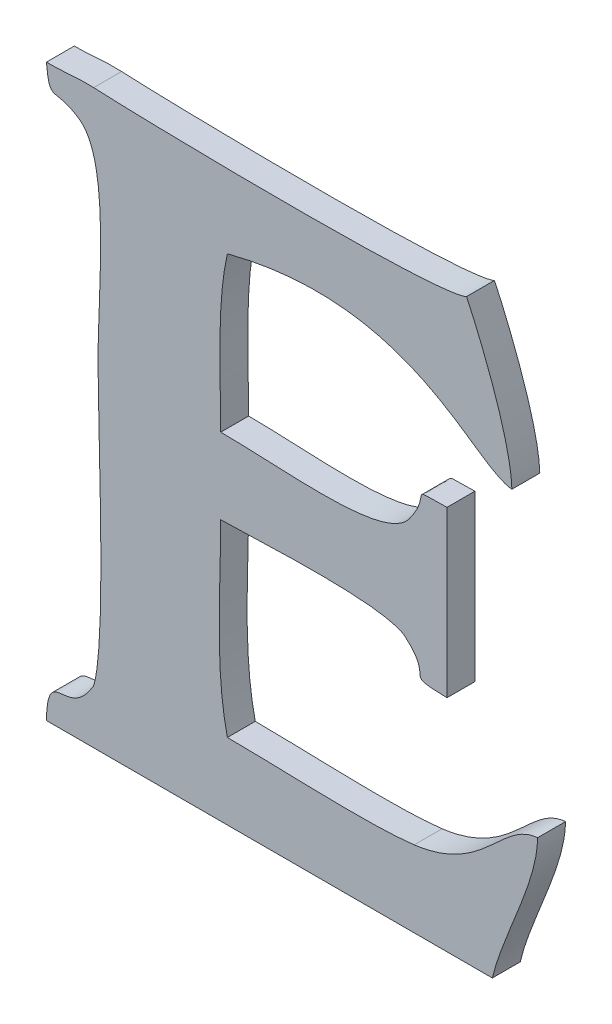
ISO-10303-21;
HEADER;
FILE_DESCRIPTION(('STEP AP214'),'2;1');
FILE_NAME('part.step','',(''),(''),'','','');
FILE_SCHEMA(('AUTOMOTIVE_DESIGN { 1 0 10303 214 1 1 1 1 }'));
ENDSEC;
DATA;
#1=APPLICATION_CONTEXT('core data for automotive mechanical design processes');
#2=APPLICATION_PROTOCOL_DEFINITION('international standard','automotive_design',2000,#1);
#3=PRODUCT_CONTEXT('',#1,'mechanical');
#4=PRODUCT('Part','Part','',(#3));
#5=PRODUCT_RELATED_PRODUCT_CATEGORY('part','',(#4));
#6=PRODUCT_DEFINITION_FORMATION('','',#4);
#7=PRODUCT_DEFINITION_CONTEXT('part definition',#1,'design');
#8=PRODUCT_DEFINITION('design','',#6,#7);
#9=PRODUCT_DEFINITION_SHAPE('','',#8);
#10=(LENGTH_UNIT() NAMED_UNIT(*) SI_UNIT(.MILLI.,.METRE.));
#11=(NAMED_UNIT(*) PLANE_ANGLE_UNIT() SI_UNIT($,.RADIAN.));
#12=(NAMED_UNIT(*) SI_UNIT($,.STERADIAN.) SOLID_ANGLE_UNIT());
#13=UNCERTAINTY_MEASURE_WITH_UNIT(LENGTH_MEASURE(1.E-05),#10,'distance_accuracy_value','');
#14=(GEOMETRIC_REPRESENTATION_CONTEXT(3) GLOBAL_UNCERTAINTY_ASSIGNED_CONTEXT((#13)) GLOBAL_UNIT_ASSIGNED_CONTEXT((#10,
#11,#12)) REPRESENTATION_CONTEXT('',''));
#15=CARTESIAN_POINT('',(0.,0.,0.));
#16=DIRECTION('',(0.,0.,1.));
#17=DIRECTION('',(1.,0.,0.));
#18=AXIS2_PLACEMENT_3D('',#15,#16,#17);
#19=CARTESIAN_POINT('',(50.1462039999998,11.250935,0.001));
#20=CARTESIAN_POINT('',(50.1462039999998,11.250935,0.));
#21=CARTESIAN_POINT('',(50.1452099999998,11.250445,0.001));
#22=CARTESIAN_POINT('',(50.1452099999998,11.250445,0.));
#23=CARTESIAN_POINT('',(50.1352839999998,11.250613,0.001));
#24=CARTESIAN_POINT('',(50.1352839999998,11.250613,0.));
#25=CARTESIAN_POINT('',(50.1328479999998,11.250739,0.001));
#26=CARTESIAN_POINT('',(50.1328479999998,11.250739,0.));
#27=B_SPLINE_SURFACE_WITH_KNOTS('',3,1,((#19,#20),(#21,#22),(#23,#24),(#25,#26)),.UNSPECIFIED.,
.F.,.F.,.F.,(4,4),(2,2),(0.85,0.9),(0.,1.),.UNSPECIFIED.);
#28=CARTESIAN_POINT('',(50.1462039999998,11.250935,0.));
#29=CARTESIAN_POINT('',(50.1452099999998,11.250445,0.));
#30=CARTESIAN_POINT('',(50.1352839999998,11.250613,0.));
#31=CARTESIAN_POINT('',(50.1328479999998,11.250739,0.));
#32=B_SPLINE_CURVE_WITH_KNOTS('',3,(#28,#29,#30,#31),.UNSPECIFIED.,.F.,.F.,(4,4),(0.85,0.9),.UNSPECIFIED.);
#33=CARTESIAN_POINT('',(50.1462039999998,11.250935,0.));
#34=VERTEX_POINT('',#33);
#35=CARTESIAN_POINT('',(50.1328479999998,11.250739,0.));
#36=VERTEX_POINT('',#35);
#37=EDGE_CURVE('E11',#34,#36,#32,.T.);
#38=DIRECTION('',(0.,0.,-1.));
#39=VECTOR('',#38,1.);
#40=CARTESIAN_POINT('',(50.1328479999998,11.250739,0.001));
#41=LINE('',#40,#39);
#42=CARTESIAN_POINT('',(50.1328479999998,11.250739,0.001));
#43=VERTEX_POINT('',#42);
#44=EDGE_CURVE('E28',#43,#36,#41,.T.);
#45=CARTESIAN_POINT('',(50.1462039999998,11.250935,0.001));
#46=CARTESIAN_POINT('',(50.1452099999998,11.250445,0.001));
#47=CARTESIAN_POINT('',(50.1352839999998,11.250613,0.001));
#48=CARTESIAN_POINT('',(50.1328479999998,11.250739,0.001));
#49=B_SPLINE_CURVE_WITH_KNOTS('',3,(#45,#46,#47,#48),.UNSPECIFIED.,.F.,.F.,(4,4),(0.85,0.9),.UNSPECIFIED.);
#50=CARTESIAN_POINT('',(50.1462039999998,11.250935,0.001));
#51=VERTEX_POINT('',#50);
#52=EDGE_CURVE('E449',#51,#43,#49,.T.);
#53=DIRECTION('',(0.,0.,-1.));
#54=VECTOR('',#53,1.);
#55=CARTESIAN_POINT('',(50.1462039999998,11.250935,0.001));
#56=LINE('',#55,#54);
#57=EDGE_CURVE('E40',#51,#34,#56,.T.);
#58=ORIENTED_EDGE('',*,*,#37,.T.);
#59=ORIENTED_EDGE('',*,*,#44,.F.);
#60=ORIENTED_EDGE('',*,*,#52,.F.);
#61=ORIENTED_EDGE('',*,*,#57,.T.);
#62=EDGE_LOOP('',(#58,#59,#60,#61));
#63=FACE_BOUND('',#62,.T.);
#64=ADVANCED_FACE('F17',(#63),#27,.F.);
#65=CARTESIAN_POINT('',(50.1328479999998,11.250739,0.001));
#66=CARTESIAN_POINT('',(50.1328479999998,11.250739,0.));
#67=CARTESIAN_POINT('',(50.1321759999998,11.250767,0.001));
#68=CARTESIAN_POINT('',(50.1321759999998,11.250767,0.));
#69=CARTESIAN_POINT('',(50.1319939999998,11.250683,0.001));
#70=CARTESIAN_POINT('',(50.1319939999998,11.250683,0.));
#71=CARTESIAN_POINT('',(50.1311539999998,11.250683,0.001));
#72=CARTESIAN_POINT('',(50.1311539999998,11.250683,0.));
#73=B_SPLINE_SURFACE_WITH_KNOTS('',3,1,((#65,#66),(#67,#68),(#69,#70),(#71,#72)),.UNSPECIFIED.,
.F.,.F.,.F.,(4,4),(2,2),(0.9,1.),(0.,1.),.UNSPECIFIED.);
#74=CARTESIAN_POINT('',(50.1328479999998,11.250739,0.));
#75=CARTESIAN_POINT('',(50.1321759999998,11.250767,0.));
#76=CARTESIAN_POINT('',(50.1319939999998,11.250683,0.));
#77=CARTESIAN_POINT('',(50.1311539999998,11.250683,0.));
#78=B_SPLINE_CURVE_WITH_KNOTS('',3,(#74,#75,#76,#77),.UNSPECIFIED.,.F.,.F.,(4,4),(0.9,1.),.UNSPECIFIED.);
#79=CARTESIAN_POINT('',(50.1311539999998,11.250683,0.));
#80=VERTEX_POINT('',#79);
#81=EDGE_CURVE('E441',#36,#80,#78,.T.);
#82=DIRECTION('',(0.,0.,-1.));
#83=VECTOR('',#82,1.);
#84=CARTESIAN_POINT('',(50.1311539999998,11.250683,0.001));
#85=LINE('',#84,#83);
#86=CARTESIAN_POINT('',(50.1311539999998,11.250683,0.001));
#87=VERTEX_POINT('',#86);
#88=EDGE_CURVE('E436',#87,#80,#85,.T.);
#89=CARTESIAN_POINT('',(50.1328479999998,11.250739,0.001));
#90=CARTESIAN_POINT('',(50.1321759999998,11.250767,0.001));
#91=CARTESIAN_POINT('',(50.1319939999998,11.250683,0.001));
#92=CARTESIAN_POINT('',(50.1311539999998,11.250683,0.001));
#93=B_SPLINE_CURVE_WITH_KNOTS('',3,(#89,#90,#91,#92),.UNSPECIFIED.,.F.,.F.,(4,4),(0.9,1.),.UNSPECIFIED.);
#94=EDGE_CURVE('E429',#43,#87,#93,.T.);
#95=ORIENTED_EDGE('',*,*,#81,.T.);
#96=ORIENTED_EDGE('',*,*,#88,.F.);
#97=ORIENTED_EDGE('',*,*,#94,.F.);
#98=ORIENTED_EDGE('',*,*,#44,.T.);
#99=EDGE_LOOP('',(#95,#96,#97,#98));
#100=FACE_BOUND('',#99,.T.);
#101=ADVANCED_FACE('F457',(#100),#73,.F.);
#102=CARTESIAN_POINT('',(50.1311539999998,11.250683,0.001));
#103=CARTESIAN_POINT('',(50.1311539999998,11.250683,0.));
#104=CARTESIAN_POINT('',(50.1312799999998,11.249395,0.001));
#105=CARTESIAN_POINT('',(50.1312799999998,11.249395,0.));
#106=CARTESIAN_POINT('',(50.1314059999998,11.250151,0.001));
#107=CARTESIAN_POINT('',(50.1314059999998,11.250151,0.));
#108=CARTESIAN_POINT('',(50.1323439999998,11.249493,0.001));
#109=CARTESIAN_POINT('',(50.1323439999998,11.249493,0.));
#110=B_SPLINE_SURFACE_WITH_KNOTS('',3,1,((#102,#103),(#104,#105),(#106,#107),(#108,#109)),
.UNSPECIFIED.,.F.,.F.,.F.,(4,4),(2,2),(0.,0.05),(0.,1.),.UNSPECIFIED.);
#111=CARTESIAN_POINT('',(50.1311539999998,11.250683,0.));
#112=CARTESIAN_POINT('',(50.1312799999998,11.249395,0.));
#113=CARTESIAN_POINT('',(50.1314059999998,11.250151,0.));
#114=CARTESIAN_POINT('',(50.1323439999998,11.249493,0.));
#115=B_SPLINE_CURVE_WITH_KNOTS('',3,(#111,#112,#113,#114),.UNSPECIFIED.,.F.,.F.,(4,4),(0.,0.05),.UNSPECIFIED.);
#116=CARTESIAN_POINT('',(50.1323439999998,11.249493,0.));
#117=VERTEX_POINT('',#116);
#118=EDGE_CURVE('E424',#80,#117,#115,.T.);
#119=DIRECTION('',(0.,0.,-1.));
#120=VECTOR('',#119,1.);
#121=CARTESIAN_POINT('',(50.1323439999998,11.249493,0.001));
#122=LINE('',#121,#120);
#123=CARTESIAN_POINT('',(50.1323439999998,11.249493,0.001));
#124=VERTEX_POINT('',#123);
#125=EDGE_CURVE('E419',#124,#117,#122,.T.);
#126=CARTESIAN_POINT('',(50.1311539999998,11.250683,0.001));
#127=CARTESIAN_POINT('',(50.1312799999998,11.249395,0.001));
#128=CARTESIAN_POINT('',(50.1314059999998,11.250151,0.001));
#129=CARTESIAN_POINT('',(50.1323439999998,11.249493,0.001));
#130=B_SPLINE_CURVE_WITH_KNOTS('',3,(#126,#127,#128,#129),.UNSPECIFIED.,.F.,.F.,(4,4),(0.,0.05),.UNSPECIFIED.);
#131=EDGE_CURVE('E412',#87,#124,#130,.T.);
#132=ORIENTED_EDGE('',*,*,#118,.T.);
#133=ORIENTED_EDGE('',*,*,#125,.F.);
#134=ORIENTED_EDGE('',*,*,#131,.F.);
#135=ORIENTED_EDGE('',*,*,#88,.T.);
#136=EDGE_LOOP('',(#132,#133,#134,#135));
#137=FACE_BOUND('',#136,.T.);
#138=ADVANCED_FACE('F462',(#137),#110,.F.);
#139=CARTESIAN_POINT('',(50.1323439999998,11.249493,0.001));
#140=CARTESIAN_POINT('',(50.1323439999998,11.249493,0.));
#141=CARTESIAN_POINT('',(50.1334639999998,11.248681,0.001));
#142=CARTESIAN_POINT('',(50.1334639999998,11.248681,0.));
#143=CARTESIAN_POINT('',(50.1330019999998,11.244593,0.001));
#144=CARTESIAN_POINT('',(50.1330019999998,11.244593,0.));
#145=CARTESIAN_POINT('',(50.1330019999998,11.242325,0.001));
#146=CARTESIAN_POINT('',(50.1330019999998,11.242325,0.));
#147=B_SPLINE_SURFACE_WITH_KNOTS('',3,1,((#139,#140),(#141,#142),(#143,#144),(#145,#146)),
.UNSPECIFIED.,.F.,.F.,.F.,(4,4),(2,2),(0.05,0.1),(0.,1.),.UNSPECIFIED.);
#148=CARTESIAN_POINT('',(50.1323439999998,11.249493,0.));
#149=CARTESIAN_POINT('',(50.1334639999998,11.248681,0.));
#150=CARTESIAN_POINT('',(50.1330019999998,11.244593,0.));
#151=CARTESIAN_POINT('',(50.1330019999998,11.242325,0.));
#152=B_SPLINE_CURVE_WITH_KNOTS('',3,(#148,#149,#150,#151),.UNSPECIFIED.,.F.,.F.,(4,4),(0.05,
0.1),.UNSPECIFIED.);
#153=CARTESIAN_POINT('',(50.1330019999998,11.242325,0.));
#154=VERTEX_POINT('',#153);
#155=EDGE_CURVE('E407',#117,#154,#152,.T.);
#156=DIRECTION('',(0.,0.,-1.));
#157=VECTOR('',#156,1.);
#158=CARTESIAN_POINT('',(50.1330019999998,11.242325,0.001));
#159=LINE('',#158,#157);
#160=CARTESIAN_POINT('',(50.1330019999998,11.242325,0.001));
#161=VERTEX_POINT('',#160);
#162=EDGE_CURVE('E402',#161,#154,#159,.T.);
#163=CARTESIAN_POINT('',(50.1323439999998,11.249493,0.001));
#164=CARTESIAN_POINT('',(50.1334639999998,11.248681,0.001));
#165=CARTESIAN_POINT('',(50.1330019999998,11.244593,0.001));
#166=CARTESIAN_POINT('',(50.1330019999998,11.242325,0.001));
#167=B_SPLINE_CURVE_WITH_KNOTS('',3,(#163,#164,#165,#166),.UNSPECIFIED.,.F.,.F.,(4,4),(0.05,
0.1),.UNSPECIFIED.);
#168=EDGE_CURVE('E395',#124,#161,#167,.T.);
#169=ORIENTED_EDGE('',*,*,#155,.T.);
#170=ORIENTED_EDGE('',*,*,#162,.F.);
#171=ORIENTED_EDGE('',*,*,#168,.F.);
#172=ORIENTED_EDGE('',*,*,#125,.T.);
#173=EDGE_LOOP('',(#169,#170,#171,#172));
#174=FACE_BOUND('',#173,.T.);
#175=ADVANCED_FACE('F468',(#174),#147,.F.);
#176=CARTESIAN_POINT('',(50.1330019999998,11.242325,0.001));
#177=CARTESIAN_POINT('',(50.1330019999998,11.242325,0.));
#178=CARTESIAN_POINT('',(50.1330019999998,11.240365,0.001));
#179=CARTESIAN_POINT('',(50.1330019999998,11.240365,0.));
#180=CARTESIAN_POINT('',(50.1333239999998,11.233505,0.001));
#181=CARTESIAN_POINT('',(50.1333239999998,11.233505,0.));
#182=CARTESIAN_POINT('',(50.1328339999998,11.232161,0.001));
#183=CARTESIAN_POINT('',(50.1328339999998,11.232161,0.));
#184=B_SPLINE_SURFACE_WITH_KNOTS('',3,1,((#176,#177),(#178,#179),(#180,#181),(#182,#183)),
.UNSPECIFIED.,.F.,.F.,.F.,(4,4),(2,2),(0.1,0.15),(0.,1.),.UNSPECIFIED.);
#185=CARTESIAN_POINT('',(50.1330019999998,11.242325,0.));
#186=CARTESIAN_POINT('',(50.1330019999998,11.240365,0.));
#187=CARTESIAN_POINT('',(50.1333239999998,11.233505,0.));
#188=CARTESIAN_POINT('',(50.1328339999998,11.232161,0.));
#189=B_SPLINE_CURVE_WITH_KNOTS('',3,(#185,#186,#187,#188),.UNSPECIFIED.,.F.,.F.,(4,4),(0.1,
0.15),.UNSPECIFIED.);
#190=CARTESIAN_POINT('',(50.1328339999998,11.232161,0.));
#191=VERTEX_POINT('',#190);
#192=EDGE_CURVE('E390',#154,#191,#189,.T.);
#193=DIRECTION('',(0.,0.,-1.));
#194=VECTOR('',#193,1.);
#195=CARTESIAN_POINT('',(50.1328339999998,11.232161,0.001));
#196=LINE('',#195,#194);
#197=CARTESIAN_POINT('',(50.1328339999998,11.232161,0.001));
#198=VERTEX_POINT('',#197);
#199=EDGE_CURVE('E385',#198,#191,#196,.T.);
#200=CARTESIAN_POINT('',(50.1330019999998,11.242325,0.001));
#201=CARTESIAN_POINT('',(50.1330019999998,11.240365,0.001));
#202=CARTESIAN_POINT('',(50.1333239999998,11.233505,0.001));
#203=CARTESIAN_POINT('',(50.1328339999998,11.232161,0.001));
#204=B_SPLINE_CURVE_WITH_KNOTS('',3,(#200,#201,#202,#203),.UNSPECIFIED.,.F.,.F.,(4,4),(0.1,
0.15),.UNSPECIFIED.);
#205=EDGE_CURVE('E378',#161,#198,#204,.T.);
#206=ORIENTED_EDGE('',*,*,#192,.T.);
#207=ORIENTED_EDGE('',*,*,#199,.F.);
#208=ORIENTED_EDGE('',*,*,#205,.F.);
#209=ORIENTED_EDGE('',*,*,#162,.T.);
#210=EDGE_LOOP('',(#206,#207,#208,#209));
#211=FACE_BOUND('',#210,.T.);
#212=ADVANCED_FACE('F472',(#211),#184,.F.);
#213=CARTESIAN_POINT('',(50.1328339999998,11.232161,0.001));
#214=CARTESIAN_POINT('',(50.1328339999998,11.232161,0.));
#215=CARTESIAN_POINT('',(50.1319239999998,11.230593,0.001));
#216=CARTESIAN_POINT('',(50.1319239999998,11.230593,0.));
#217=CARTESIAN_POINT('',(50.1311959999998,11.232203,0.001));
#218=CARTESIAN_POINT('',(50.1311959999998,11.232203,0.));
#219=CARTESIAN_POINT('',(50.1311539999998,11.230257,0.001));
#220=CARTESIAN_POINT('',(50.1311539999998,11.230257,0.));
#221=B_SPLINE_SURFACE_WITH_KNOTS('',3,1,((#213,#214),(#215,#216),(#217,#218),(#219,#220)),
.UNSPECIFIED.,.F.,.F.,.F.,(4,4),(2,2),(0.15,0.2),(0.,1.),.UNSPECIFIED.);
#222=CARTESIAN_POINT('',(50.1328339999998,11.232161,0.));
#223=CARTESIAN_POINT('',(50.1319239999998,11.230593,0.));
#224=CARTESIAN_POINT('',(50.1311959999998,11.232203,0.));
#225=CARTESIAN_POINT('',(50.1311539999998,11.230257,0.));
#226=B_SPLINE_CURVE_WITH_KNOTS('',3,(#222,#223,#224,#225),.UNSPECIFIED.,.F.,.F.,(4,4),(0.15,
0.2),.UNSPECIFIED.);
#227=CARTESIAN_POINT('',(50.1311539999998,11.230257,0.));
#228=VERTEX_POINT('',#227);
#229=EDGE_CURVE('E373',#191,#228,#226,.T.);
#230=DIRECTION('',(0.,0.,-1.));
#231=VECTOR('',#230,1.);
#232=CARTESIAN_POINT('',(50.1311539999998,11.230257,0.001));
#233=LINE('',#232,#231);
#234=CARTESIAN_POINT('',(50.1311539999998,11.230257,0.001));
#235=VERTEX_POINT('',#234);
#236=EDGE_CURVE('E368',#235,#228,#233,.T.);
#237=CARTESIAN_POINT('',(50.1328339999998,11.232161,0.001));
#238=CARTESIAN_POINT('',(50.1319239999998,11.230593,0.001));
#239=CARTESIAN_POINT('',(50.1311959999998,11.232203,0.001));
#240=CARTESIAN_POINT('',(50.1311539999998,11.230257,0.001));
#241=B_SPLINE_CURVE_WITH_KNOTS('',3,(#237,#238,#239,#240),.UNSPECIFIED.,.F.,.F.,(4,4),(0.15,
0.2),.UNSPECIFIED.);
#242=EDGE_CURVE('E364',#198,#235,#241,.T.);
#243=ORIENTED_EDGE('',*,*,#229,.T.);
#244=ORIENTED_EDGE('',*,*,#236,.F.);
#245=ORIENTED_EDGE('',*,*,#242,.F.);
#246=ORIENTED_EDGE('',*,*,#199,.T.);
#247=EDGE_LOOP('',(#243,#244,#245,#246));
#248=FACE_BOUND('',#247,.T.);
#249=ADVANCED_FACE('F477',(#248),#221,.F.);
#250=CARTESIAN_POINT('',(0.,11.230257,0.001));
#251=DIRECTION('',(0.,1.,0.));
#252=DIRECTION('',(0.,0.,1.));
#253=AXIS2_PLACEMENT_3D('',#250,#251,#252);
#254=PLANE('',#253);
#255=DIRECTION('',(1.,0.,0.));
#256=VECTOR('',#255,1.);
#257=CARTESIAN_POINT('',(0.,11.230257,0.));
#258=LINE('',#257,#256);
#259=CARTESIAN_POINT('',(50.1471279999998,11.230257,0.));
#260=VERTEX_POINT('',#259);
#261=EDGE_CURVE('E362',#228,#260,#258,.T.);
#262=ORIENTED_EDGE('',*,*,#261,.T.);
#263=DIRECTION('',(0.,0.,-1.));
#264=VECTOR('',#263,1.);
#265=CARTESIAN_POINT('',(50.1471279999998,11.230257,0.001));
#266=LINE('',#265,#264);
#267=CARTESIAN_POINT('',(50.1471279999998,11.230257,0.001));
#268=VERTEX_POINT('',#267);
#269=EDGE_CURVE('E359',#268,#260,#266,.T.);
#270=ORIENTED_EDGE('',*,*,#269,.F.);
#271=DIRECTION('',(1.,0.,0.));
#272=VECTOR('',#271,1.);
#273=CARTESIAN_POINT('',(0.,11.230257,0.001));
#274=LINE('',#273,#272);
#275=EDGE_CURVE('E353',#235,#268,#274,.T.);
#276=ORIENTED_EDGE('',*,*,#275,.F.);
#277=ORIENTED_EDGE('',*,*,#236,.T.);
#278=EDGE_LOOP('',(#262,#270,#276,#277));
#279=FACE_BOUND('',#278,.T.);
#280=ADVANCED_FACE('F530',(#279),#254,.F.);
#281=CARTESIAN_POINT('',(50.1471279999998,11.230257,0.001));
#282=CARTESIAN_POINT('',(50.1471279999998,11.230257,0.));
#283=CARTESIAN_POINT('',(50.1474919999998,11.231825,0.001));
#284=CARTESIAN_POINT('',(50.1474919999998,11.231825,0.));
#285=CARTESIAN_POINT('',(50.1487239999998,11.233897,0.001));
#286=CARTESIAN_POINT('',(50.1487239999998,11.233897,0.));
#287=CARTESIAN_POINT('',(50.1487519999998,11.235423,0.001));
#288=CARTESIAN_POINT('',(50.1487519999998,11.235423,0.));
#289=B_SPLINE_SURFACE_WITH_KNOTS('',3,1,((#281,#282),(#283,#284),(#285,#286),(#287,#288)),
.UNSPECIFIED.,.F.,.F.,.F.,(4,4),(2,2),(0.25,0.3),(0.,1.),.UNSPECIFIED.);
#290=CARTESIAN_POINT('',(50.1471279999998,11.230257,0.));
#291=CARTESIAN_POINT('',(50.1474919999998,11.231825,0.));
#292=CARTESIAN_POINT('',(50.1487239999998,11.233897,0.));
#293=CARTESIAN_POINT('',(50.1487519999998,11.235423,0.));
#294=B_SPLINE_CURVE_WITH_KNOTS('',3,(#290,#291,#292,#293),.UNSPECIFIED.,.F.,.F.,(4,4),(0.25,
0.3),.UNSPECIFIED.);
#295=CARTESIAN_POINT('',(50.1487519999998,11.235423,0.));
#296=VERTEX_POINT('',#295);
#297=EDGE_CURVE('E348',#260,#296,#294,.T.);
#298=DIRECTION('',(0.,0.,-1.));
#299=VECTOR('',#298,1.);
#300=CARTESIAN_POINT('',(50.1487519999998,11.235423,0.001));
#301=LINE('',#300,#299);
#302=CARTESIAN_POINT('',(50.1487519999998,11.235423,0.001));
#303=VERTEX_POINT('',#302);
#304=EDGE_CURVE('E343',#303,#296,#301,.T.);
#305=CARTESIAN_POINT('',(50.1471279999998,11.230257,0.001));
#306=CARTESIAN_POINT('',(50.1474919999998,11.231825,0.001));
#307=CARTESIAN_POINT('',(50.1487239999998,11.233897,0.001));
#308=CARTESIAN_POINT('',(50.1487519999998,11.235423,0.001));
#309=B_SPLINE_CURVE_WITH_KNOTS('',3,(#305,#306,#307,#308),.UNSPECIFIED.,.F.,.F.,(4,4),(0.25,
0.3),.UNSPECIFIED.);
#310=EDGE_CURVE('E336',#268,#303,#309,.T.);
#311=ORIENTED_EDGE('',*,*,#297,.T.);
#312=ORIENTED_EDGE('',*,*,#304,.F.);
#313=ORIENTED_EDGE('',*,*,#310,.F.);
#314=ORIENTED_EDGE('',*,*,#269,.T.);
#315=EDGE_LOOP('',(#311,#312,#313,#314));
#316=FACE_BOUND('',#315,.T.);
#317=ADVANCED_FACE('F483',(#316),#289,.F.);
#318=CARTESIAN_POINT('',(50.1487519999998,11.235423,0.001));
#319=CARTESIAN_POINT('',(50.1487519999998,11.235423,0.));
#320=CARTESIAN_POINT('',(50.1474219999998,11.235297,0.001));
#321=CARTESIAN_POINT('',(50.1474219999998,11.235297,0.));
#322=CARTESIAN_POINT('',(50.1468759999998,11.233309,0.001));
#323=CARTESIAN_POINT('',(50.1468759999998,11.233309,0.));
#324=CARTESIAN_POINT('',(50.1443279999998,11.232987,0.001));
#325=CARTESIAN_POINT('',(50.1443279999998,11.232987,0.));
#326=B_SPLINE_SURFACE_WITH_KNOTS('',3,1,((#318,#319),(#320,#321),(#322,#323),(#324,#325)),
.UNSPECIFIED.,.F.,.F.,.F.,(4,4),(2,2),(0.3,0.35),(0.,1.),.UNSPECIFIED.);
#327=CARTESIAN_POINT('',(50.1487519999998,11.235423,0.));
#328=CARTESIAN_POINT('',(50.1474219999998,11.235297,0.));
#329=CARTESIAN_POINT('',(50.1468759999998,11.233309,0.));
#330=CARTESIAN_POINT('',(50.1443279999998,11.232987,0.));
#331=B_SPLINE_CURVE_WITH_KNOTS('',3,(#327,#328,#329,#330),.UNSPECIFIED.,.F.,.F.,(4,4),(0.3,
0.35),.UNSPECIFIED.);
#332=CARTESIAN_POINT('',(50.1443279999998,11.232987,0.));
#333=VERTEX_POINT('',#332);
#334=EDGE_CURVE('E331',#296,#333,#331,.T.);
#335=DIRECTION('',(0.,0.,-1.));
#336=VECTOR('',#335,1.);
#337=CARTESIAN_POINT('',(50.1443279999998,11.232987,0.001));
#338=LINE('',#337,#336);
#339=CARTESIAN_POINT('',(50.1443279999998,11.232987,0.001));
#340=VERTEX_POINT('',#339);
#341=EDGE_CURVE('E326',#340,#333,#338,.T.);
#342=CARTESIAN_POINT('',(50.1487519999998,11.235423,0.001));
#343=CARTESIAN_POINT('',(50.1474219999998,11.235297,0.001));
#344=CARTESIAN_POINT('',(50.1468759999998,11.233309,0.001));
#345=CARTESIAN_POINT('',(50.1443279999998,11.232987,0.001));
#346=B_SPLINE_CURVE_WITH_KNOTS('',3,(#342,#343,#344,#345),.UNSPECIFIED.,.F.,.F.,(4,4),(0.3,
0.35),.UNSPECIFIED.);
#347=EDGE_CURVE('E319',#303,#340,#346,.T.);
#348=ORIENTED_EDGE('',*,*,#334,.T.);
#349=ORIENTED_EDGE('',*,*,#341,.F.);
#350=ORIENTED_EDGE('',*,*,#347,.F.);
#351=ORIENTED_EDGE('',*,*,#304,.T.);
#352=EDGE_LOOP('',(#348,#349,#350,#351));
#353=FACE_BOUND('',#352,.T.);
#354=ADVANCED_FACE('F489',(#353),#326,.F.);
#355=CARTESIAN_POINT('',(50.1443279999998,11.232987,0.001));
#356=CARTESIAN_POINT('',(50.1443279999998,11.232987,0.));
#357=CARTESIAN_POINT('',(50.1425779999998,11.232777,0.001));
#358=CARTESIAN_POINT('',(50.1425779999998,11.232777,0.));
#359=CARTESIAN_POINT('',(50.1395259999998,11.232973,0.001));
#360=CARTESIAN_POINT('',(50.1395259999998,11.232973,0.));
#361=CARTESIAN_POINT('',(50.1376359999998,11.232973,0.001));
#362=CARTESIAN_POINT('',(50.1376359999998,11.232973,0.));
#363=B_SPLINE_SURFACE_WITH_KNOTS('',3,1,((#355,#356),(#357,#358),(#359,#360),(#361,#362)),
.UNSPECIFIED.,.F.,.F.,.F.,(4,4),(2,2),(0.35,0.4),(0.,1.),.UNSPECIFIED.);
#364=CARTESIAN_POINT('',(50.1443279999998,11.232987,0.));
#365=CARTESIAN_POINT('',(50.1425779999998,11.232777,0.));
#366=CARTESIAN_POINT('',(50.1395259999998,11.232973,0.));
#367=CARTESIAN_POINT('',(50.1376359999998,11.232973,0.));
#368=B_SPLINE_CURVE_WITH_KNOTS('',3,(#364,#365,#366,#367),.UNSPECIFIED.,.F.,.F.,(4,4),(0.35,
0.4),.UNSPECIFIED.);
#369=CARTESIAN_POINT('',(50.1376359999998,11.232973,0.));
#370=VERTEX_POINT('',#369);
#371=EDGE_CURVE('E314',#333,#370,#368,.T.);
#372=DIRECTION('',(0.,0.,-1.));
#373=VECTOR('',#372,1.);
#374=CARTESIAN_POINT('',(50.1376359999998,11.232973,0.001));
#375=LINE('',#374,#373);
#376=CARTESIAN_POINT('',(50.1376359999998,11.232973,0.001));
#377=VERTEX_POINT('',#376);
#378=EDGE_CURVE('E309',#377,#370,#375,.T.);
#379=CARTESIAN_POINT('',(50.1443279999998,11.232987,0.001));
#380=CARTESIAN_POINT('',(50.1425779999998,11.232777,0.001));
#381=CARTESIAN_POINT('',(50.1395259999998,11.232973,0.001));
#382=CARTESIAN_POINT('',(50.1376359999998,11.232973,0.001));
#383=B_SPLINE_CURVE_WITH_KNOTS('',3,(#379,#380,#381,#382),.UNSPECIFIED.,.F.,.F.,(4,4),(0.35,
0.4),.UNSPECIFIED.);
#384=EDGE_CURVE('E302',#340,#377,#383,.T.);
#385=ORIENTED_EDGE('',*,*,#371,.T.);
#386=ORIENTED_EDGE('',*,*,#378,.F.);
#387=ORIENTED_EDGE('',*,*,#384,.F.);
#388=ORIENTED_EDGE('',*,*,#341,.T.);
#389=EDGE_LOOP('',(#385,#386,#387,#388));
#390=FACE_BOUND('',#389,.T.);
#391=ADVANCED_FACE('F495',(#390),#363,.F.);
#392=CARTESIAN_POINT('',(50.1376359999998,11.232973,0.001));
#393=CARTESIAN_POINT('',(50.1376359999998,11.232973,0.));
#394=CARTESIAN_POINT('',(50.1371739999998,11.234989,0.001));
#395=CARTESIAN_POINT('',(50.1371739999998,11.234989,0.));
#396=CARTESIAN_POINT('',(50.1373979999998,11.237439,0.001));
#397=CARTESIAN_POINT('',(50.1373979999998,11.237439,0.));
#398=CARTESIAN_POINT('',(50.1373979999998,11.239609,0.001));
#399=CARTESIAN_POINT('',(50.1373979999998,11.239609,0.));
#400=B_SPLINE_SURFACE_WITH_KNOTS('',3,1,((#392,#393),(#394,#395),(#396,#397),(#398,#399)),
.UNSPECIFIED.,.F.,.F.,.F.,(4,4),(2,2),(0.4,0.45),(0.,1.),.UNSPECIFIED.);
#401=CARTESIAN_POINT('',(50.1376359999998,11.232973,0.));
#402=CARTESIAN_POINT('',(50.1371739999998,11.234989,0.));
#403=CARTESIAN_POINT('',(50.1373979999998,11.237439,0.));
#404=CARTESIAN_POINT('',(50.1373979999998,11.239609,0.));
#405=B_SPLINE_CURVE_WITH_KNOTS('',3,(#401,#402,#403,#404),.UNSPECIFIED.,.F.,.F.,(4,4),(0.4,
0.45),.UNSPECIFIED.);
#406=CARTESIAN_POINT('',(50.1373979999998,11.239609,0.));
#407=VERTEX_POINT('',#406);
#408=EDGE_CURVE('E297',#370,#407,#405,.T.);
#409=DIRECTION('',(0.,0.,-1.));
#410=VECTOR('',#409,1.);
#411=CARTESIAN_POINT('',(50.1373979999998,11.239609,0.001));
#412=LINE('',#411,#410);
#413=CARTESIAN_POINT('',(50.1373979999998,11.239609,0.001));
#414=VERTEX_POINT('',#413);
#415=EDGE_CURVE('E292',#414,#407,#412,.T.);
#416=CARTESIAN_POINT('',(50.1376359999998,11.232973,0.001));
#417=CARTESIAN_POINT('',(50.1371739999998,11.234989,0.001));
#418=CARTESIAN_POINT('',(50.1373979999998,11.237439,0.001));
#419=CARTESIAN_POINT('',(50.1373979999998,11.239609,0.001));
#420=B_SPLINE_CURVE_WITH_KNOTS('',3,(#416,#417,#418,#419),.UNSPECIFIED.,.F.,.F.,(4,4),(0.4,
0.45),.UNSPECIFIED.);
#421=EDGE_CURVE('E285',#377,#414,#420,.T.);
#422=ORIENTED_EDGE('',*,*,#408,.T.);
#423=ORIENTED_EDGE('',*,*,#415,.F.);
#424=ORIENTED_EDGE('',*,*,#421,.F.);
#425=ORIENTED_EDGE('',*,*,#378,.T.);
#426=EDGE_LOOP('',(#422,#423,#424,#425));
#427=FACE_BOUND('',#426,.T.);
#428=ADVANCED_FACE('F499',(#427),#400,.F.);
#429=CARTESIAN_POINT('',(50.1373979999998,11.239609,0.001));
#430=CARTESIAN_POINT('',(50.1373979999998,11.239609,0.));
#431=CARTESIAN_POINT('',(50.1385039999998,11.239609,0.001));
#432=CARTESIAN_POINT('',(50.1385039999998,11.239609,0.));
#433=CARTESIAN_POINT('',(50.1432639999998,11.239931,0.001));
#434=CARTESIAN_POINT('',(50.1432639999998,11.239931,0.));
#435=CARTESIAN_POINT('',(50.1440199999998,11.239273,0.001));
#436=CARTESIAN_POINT('',(50.1440199999998,11.239273,0.));
#437=B_SPLINE_SURFACE_WITH_KNOTS('',3,1,((#429,#430),(#431,#432),(#433,#434),(#435,#436)),
.UNSPECIFIED.,.F.,.F.,.F.,(4,4),(2,2),(0.45,0.5),(0.,1.),.UNSPECIFIED.);
#438=CARTESIAN_POINT('',(50.1373979999998,11.239609,0.));
#439=CARTESIAN_POINT('',(50.1385039999998,11.239609,0.));
#440=CARTESIAN_POINT('',(50.1432639999998,11.239931,0.));
#441=CARTESIAN_POINT('',(50.1440199999998,11.239273,0.));
#442=B_SPLINE_CURVE_WITH_KNOTS('',3,(#438,#439,#440,#441),.UNSPECIFIED.,.F.,.F.,(4,4),(0.45,
0.5),.UNSPECIFIED.);
#443=CARTESIAN_POINT('',(50.1440199999998,11.239273,0.));
#444=VERTEX_POINT('',#443);
#445=EDGE_CURVE('E280',#407,#444,#442,.T.);
#446=DIRECTION('',(0.,0.,-1.));
#447=VECTOR('',#446,1.);
#448=CARTESIAN_POINT('',(50.1440199999998,11.239273,0.001));
#449=LINE('',#448,#447);
#450=CARTESIAN_POINT('',(50.1440199999998,11.239273,0.001));
#451=VERTEX_POINT('',#450);
#452=EDGE_CURVE('E275',#451,#444,#449,.T.);
#453=CARTESIAN_POINT('',(50.1373979999998,11.239609,0.001));
#454=CARTESIAN_POINT('',(50.1385039999998,11.239609,0.001));
#455=CARTESIAN_POINT('',(50.1432639999998,11.239931,0.001));
#456=CARTESIAN_POINT('',(50.1440199999998,11.239273,0.001));
#457=B_SPLINE_CURVE_WITH_KNOTS('',3,(#453,#454,#455,#456),.UNSPECIFIED.,.F.,.F.,(4,4),(0.45,
0.5),.UNSPECIFIED.);
#458=EDGE_CURVE('E268',#414,#451,#457,.T.);
#459=ORIENTED_EDGE('',*,*,#445,.T.);
#460=ORIENTED_EDGE('',*,*,#452,.F.);
#461=ORIENTED_EDGE('',*,*,#458,.F.);
#462=ORIENTED_EDGE('',*,*,#415,.T.);
#463=EDGE_LOOP('',(#459,#460,#461,#462));
#464=FACE_BOUND('',#463,.T.);
#465=ADVANCED_FACE('F504',(#464),#437,.F.);
#466=CARTESIAN_POINT('',(50.1440199999998,11.239273,0.001));
#467=CARTESIAN_POINT('',(50.1440199999998,11.239273,0.));
#468=CARTESIAN_POINT('',(50.1451259999998,11.238307,0.001));
#469=CARTESIAN_POINT('',(50.1451259999998,11.238307,0.));
#470=CARTESIAN_POINT('',(50.1437959999998,11.238181,0.001));
#471=CARTESIAN_POINT('',(50.1437959999998,11.238181,0.));
#472=CARTESIAN_POINT('',(50.1455039999998,11.238139,0.001));
#473=CARTESIAN_POINT('',(50.1455039999998,11.238139,0.));
#474=B_SPLINE_SURFACE_WITH_KNOTS('',3,1,((#466,#467),(#468,#469),(#470,#471),(#472,#473)),
.UNSPECIFIED.,.F.,.F.,.F.,(4,4),(2,2),(0.5,0.55),(0.,1.),.UNSPECIFIED.);
#475=CARTESIAN_POINT('',(50.1440199999998,11.239273,0.));
#476=CARTESIAN_POINT('',(50.1451259999998,11.238307,0.));
#477=CARTESIAN_POINT('',(50.1437959999998,11.238181,0.));
#478=CARTESIAN_POINT('',(50.1455039999998,11.238139,0.));
#479=B_SPLINE_CURVE_WITH_KNOTS('',3,(#475,#476,#477,#478),.UNSPECIFIED.,.F.,.F.,(4,4),(0.5,
0.55),.UNSPECIFIED.);
#480=CARTESIAN_POINT('',(50.1455039999998,11.238139,0.));
#481=VERTEX_POINT('',#480);
#482=EDGE_CURVE('E263',#444,#481,#479,.T.);
#483=DIRECTION('',(0.,0.,-1.));
#484=VECTOR('',#483,1.);
#485=CARTESIAN_POINT('',(50.1455039999998,11.238139,0.001));
#486=LINE('',#485,#484);
#487=CARTESIAN_POINT('',(50.1455039999998,11.238139,0.001));
#488=VERTEX_POINT('',#487);
#489=EDGE_CURVE('E258',#488,#481,#486,.T.);
#490=CARTESIAN_POINT('',(50.1440199999998,11.239273,0.001));
#491=CARTESIAN_POINT('',(50.1451259999998,11.238307,0.001));
#492=CARTESIAN_POINT('',(50.1437959999998,11.238181,0.001));
#493=CARTESIAN_POINT('',(50.1455039999998,11.238139,0.001));
#494=B_SPLINE_CURVE_WITH_KNOTS('',3,(#490,#491,#492,#493),.UNSPECIFIED.,.F.,.F.,(4,4),(0.5,
0.55),.UNSPECIFIED.);
#495=EDGE_CURVE('E254',#451,#488,#494,.T.);
#496=ORIENTED_EDGE('',*,*,#482,.T.);
#497=ORIENTED_EDGE('',*,*,#489,.F.);
#498=ORIENTED_EDGE('',*,*,#495,.F.);
#499=ORIENTED_EDGE('',*,*,#452,.T.);
#500=EDGE_LOOP('',(#496,#497,#498,#499));
#501=FACE_BOUND('',#500,.T.);
#502=ADVANCED_FACE('F510',(#501),#474,.F.);
#503=CARTESIAN_POINT('',(50.1455039999998,0.,0.001));
#504=DIRECTION('',(-1.,0.,0.));
#505=DIRECTION('',(0.,0.,1.));
#506=AXIS2_PLACEMENT_3D('',#503,#504,#505);
#507=PLANE('',#506);
#508=DIRECTION('',(0.,1.,0.));
#509=VECTOR('',#508,1.);
#510=CARTESIAN_POINT('',(50.1455039999998,0.,0.));
#511=LINE('',#510,#509);
#512=CARTESIAN_POINT('',(50.1455039999998,11.244047,0.));
#513=VERTEX_POINT('',#512);
#514=EDGE_CURVE('E252',#481,#513,#511,.T.);
#515=ORIENTED_EDGE('',*,*,#514,.T.);
#516=DIRECTION('',(0.,0.,-1.));
#517=VECTOR('',#516,1.);
#518=CARTESIAN_POINT('',(50.1455039999998,11.244047,0.001));
#519=LINE('',#518,#517);
#520=CARTESIAN_POINT('',(50.1455039999998,11.244047,0.001));
#521=VERTEX_POINT('',#520);
#522=EDGE_CURVE('E249',#521,#513,#519,.T.);
#523=ORIENTED_EDGE('',*,*,#522,.F.);
#524=DIRECTION('',(0.,1.,0.));
#525=VECTOR('',#524,1.);
#526=CARTESIAN_POINT('',(50.1455039999998,0.,0.001));
#527=LINE('',#526,#525);
#528=EDGE_CURVE('E243',#488,#521,#527,.T.);
#529=ORIENTED_EDGE('',*,*,#528,.F.);
#530=ORIENTED_EDGE('',*,*,#489,.T.);
#531=EDGE_LOOP('',(#515,#523,#529,#530));
#532=FACE_BOUND('',#531,.T.);
#533=ADVANCED_FACE('F514',(#532),#507,.F.);
#534=CARTESIAN_POINT('',(50.1455039999998,11.244047,0.001));
#535=CARTESIAN_POINT('',(50.1455039999998,11.244047,0.));
#536=CARTESIAN_POINT('',(50.1439919999998,11.244005,0.001));
#537=CARTESIAN_POINT('',(50.1439919999998,11.244005,0.));
#538=CARTESIAN_POINT('',(50.1450139999998,11.244201,0.001));
#539=CARTESIAN_POINT('',(50.1450139999998,11.244201,0.));
#540=CARTESIAN_POINT('',(50.1441599999998,11.243025,0.001));
#541=CARTESIAN_POINT('',(50.1441599999998,11.243025,0.));
#542=B_SPLINE_SURFACE_WITH_KNOTS('',3,1,((#534,#535),(#536,#537),(#538,#539),(#540,#541)),
.UNSPECIFIED.,.F.,.F.,.F.,(4,4),(2,2),(0.6,0.65),(0.,1.),.UNSPECIFIED.);
#543=CARTESIAN_POINT('',(50.1455039999998,11.244047,0.));
#544=CARTESIAN_POINT('',(50.1439919999998,11.244005,0.));
#545=CARTESIAN_POINT('',(50.1450139999998,11.244201,0.));
#546=CARTESIAN_POINT('',(50.1441599999998,11.243025,0.));
#547=B_SPLINE_CURVE_WITH_KNOTS('',3,(#543,#544,#545,#546),.UNSPECIFIED.,.F.,.F.,(4,4),(0.6,
0.65),.UNSPECIFIED.);
#548=CARTESIAN_POINT('',(50.1441599999998,11.243025,0.));
#549=VERTEX_POINT('',#548);
#550=EDGE_CURVE('E238',#513,#549,#547,.T.);
#551=DIRECTION('',(0.,0.,-1.));
#552=VECTOR('',#551,1.);
#553=CARTESIAN_POINT('',(50.1441599999998,11.243025,0.001));
#554=LINE('',#553,#552);
#555=CARTESIAN_POINT('',(50.1441599999998,11.243025,0.001));
#556=VERTEX_POINT('',#555);
#557=EDGE_CURVE('E233',#556,#549,#554,.T.);
#558=CARTESIAN_POINT('',(50.1455039999998,11.244047,0.001));
#559=CARTESIAN_POINT('',(50.1439919999998,11.244005,0.001));
#560=CARTESIAN_POINT('',(50.1450139999998,11.244201,0.001));
#561=CARTESIAN_POINT('',(50.1441599999998,11.243025,0.001));
#562=B_SPLINE_CURVE_WITH_KNOTS('',3,(#558,#559,#560,#561),.UNSPECIFIED.,.F.,.F.,(4,4),(0.6,
0.65),.UNSPECIFIED.);
#563=EDGE_CURVE('E226',#521,#556,#562,.T.);
#564=ORIENTED_EDGE('',*,*,#550,.T.);
#565=ORIENTED_EDGE('',*,*,#557,.F.);
#566=ORIENTED_EDGE('',*,*,#563,.F.);
#567=ORIENTED_EDGE('',*,*,#522,.T.);
#568=EDGE_LOOP('',(#564,#565,#566,#567));
#569=FACE_BOUND('',#568,.T.);
#570=ADVANCED_FACE('F517',(#569),#542,.F.);
#571=CARTESIAN_POINT('',(50.1441599999998,11.243025,0.001));
#572=CARTESIAN_POINT('',(50.1441599999998,11.243025,0.));
#573=CARTESIAN_POINT('',(50.1432779999998,11.241821,0.001));
#574=CARTESIAN_POINT('',(50.1432779999998,11.241821,0.));
#575=CARTESIAN_POINT('',(50.1397499999998,11.242325,0.001));
#576=CARTESIAN_POINT('',(50.1397499999998,11.242325,0.));
#577=CARTESIAN_POINT('',(50.1373979999998,11.242325,0.001));
#578=CARTESIAN_POINT('',(50.1373979999998,11.242325,0.));
#579=B_SPLINE_SURFACE_WITH_KNOTS('',3,1,((#571,#572),(#573,#574),(#575,#576),(#577,#578)),
.UNSPECIFIED.,.F.,.F.,.F.,(4,4),(2,2),(0.65,0.7),(0.,1.),.UNSPECIFIED.);
#580=CARTESIAN_POINT('',(50.1441599999998,11.243025,0.));
#581=CARTESIAN_POINT('',(50.1432779999998,11.241821,0.));
#582=CARTESIAN_POINT('',(50.1397499999998,11.242325,0.));
#583=CARTESIAN_POINT('',(50.1373979999998,11.242325,0.));
#584=B_SPLINE_CURVE_WITH_KNOTS('',3,(#580,#581,#582,#583),.UNSPECIFIED.,.F.,.F.,(4,4),(0.65,
0.7),.UNSPECIFIED.);
#585=CARTESIAN_POINT('',(50.1373979999998,11.242325,0.));
#586=VERTEX_POINT('',#585);
#587=EDGE_CURVE('E221',#549,#586,#584,.T.);
#588=DIRECTION('',(0.,0.,-1.));
#589=VECTOR('',#588,1.);
#590=CARTESIAN_POINT('',(50.1373979999998,11.242325,0.001));
#591=LINE('',#590,#589);
#592=CARTESIAN_POINT('',(50.1373979999998,11.242325,0.001));
#593=VERTEX_POINT('',#592);
#594=EDGE_CURVE('E216',#593,#586,#591,.T.);
#595=CARTESIAN_POINT('',(50.1441599999998,11.243025,0.001));
#596=CARTESIAN_POINT('',(50.1432779999998,11.241821,0.001));
#597=CARTESIAN_POINT('',(50.1397499999998,11.242325,0.001));
#598=CARTESIAN_POINT('',(50.1373979999998,11.242325,0.001));
#599=B_SPLINE_CURVE_WITH_KNOTS('',3,(#595,#596,#597,#598),.UNSPECIFIED.,.F.,.F.,(4,4),(0.65,
0.7),.UNSPECIFIED.);
#600=EDGE_CURVE('E209',#556,#593,#599,.T.);
#601=ORIENTED_EDGE('',*,*,#587,.T.);
#602=ORIENTED_EDGE('',*,*,#594,.F.);
#603=ORIENTED_EDGE('',*,*,#600,.F.);
#604=ORIENTED_EDGE('',*,*,#557,.T.);
#605=EDGE_LOOP('',(#601,#602,#603,#604));
#606=FACE_BOUND('',#605,.T.);
#607=ADVANCED_FACE('F525',(#606),#579,.F.);
#608=CARTESIAN_POINT('',(50.1373979999998,11.242325,0.001));
#609=CARTESIAN_POINT('',(50.1373979999998,11.242325,0.));
#610=CARTESIAN_POINT('',(50.1373979999998,11.244201,0.001));
#611=CARTESIAN_POINT('',(50.1373979999998,11.244201,0.));
#612=CARTESIAN_POINT('',(50.1372439999998,11.246245,0.001));
#613=CARTESIAN_POINT('',(50.1372439999998,11.246245,0.));
#614=CARTESIAN_POINT('',(50.1376359999998,11.247981,0.001));
#615=CARTESIAN_POINT('',(50.1376359999998,11.247981,0.));
#616=B_SPLINE_SURFACE_WITH_KNOTS('',3,1,((#608,#609),(#610,#611),(#612,#613),(#614,#615)),
.UNSPECIFIED.,.F.,.F.,.F.,(4,4),(2,2),(0.7,0.75),(0.,1.),.UNSPECIFIED.);
#617=CARTESIAN_POINT('',(50.1373979999998,11.242325,0.));
#618=CARTESIAN_POINT('',(50.1373979999998,11.244201,0.));
#619=CARTESIAN_POINT('',(50.1372439999998,11.246245,0.));
#620=CARTESIAN_POINT('',(50.1376359999998,11.247981,0.));
#621=B_SPLINE_CURVE_WITH_KNOTS('',3,(#617,#618,#619,#620),.UNSPECIFIED.,.F.,.F.,(4,4),(0.7,
0.75),.UNSPECIFIED.);
#622=CARTESIAN_POINT('',(50.1376359999998,11.247981,0.));
#623=VERTEX_POINT('',#622);
#624=EDGE_CURVE('E204',#586,#623,#621,.T.);
#625=DIRECTION('',(0.,0.,-1.));
#626=VECTOR('',#625,1.);
#627=CARTESIAN_POINT('',(50.1376359999998,11.247981,0.001));
#628=LINE('',#627,#626);
#629=CARTESIAN_POINT('',(50.1376359999998,11.247981,0.001));
#630=VERTEX_POINT('',#629);
#631=EDGE_CURVE('E199',#630,#623,#628,.T.);
#632=CARTESIAN_POINT('',(50.1373979999998,11.242325,0.001));
#633=CARTESIAN_POINT('',(50.1373979999998,11.244201,0.001));
#634=CARTESIAN_POINT('',(50.1372439999998,11.246245,0.001));
#635=CARTESIAN_POINT('',(50.1376359999998,11.247981,0.001));
#636=B_SPLINE_CURVE_WITH_KNOTS('',3,(#632,#633,#634,#635),.UNSPECIFIED.,.F.,.F.,(4,4),(0.7,
0.75),.UNSPECIFIED.);
#637=EDGE_CURVE('E157',#593,#630,#636,.T.);
#638=ORIENTED_EDGE('',*,*,#624,.T.);
#639=ORIENTED_EDGE('',*,*,#631,.F.);
#640=ORIENTED_EDGE('',*,*,#637,.F.);
#641=ORIENTED_EDGE('',*,*,#594,.T.);
#642=EDGE_LOOP('',(#638,#639,#640,#641));
#643=FACE_BOUND('',#642,.T.);
#644=ADVANCED_FACE('F528',(#643),#616,.F.);
#645=CARTESIAN_POINT('',(50.1376359999998,11.247981,0.001));
#646=CARTESIAN_POINT('',(50.1376359999998,11.247981,0.));
#647=CARTESIAN_POINT('',(50.1442439999998,11.249675,0.001));
#648=CARTESIAN_POINT('',(50.1442439999998,11.249675,0.));
#649=CARTESIAN_POINT('',(50.1463999999998,11.245895,0.001));
#650=CARTESIAN_POINT('',(50.1463999999998,11.245895,0.));
#651=CARTESIAN_POINT('',(50.1478279999998,11.245769,0.001));
#652=CARTESIAN_POINT('',(50.1478279999998,11.245769,0.));
#653=B_SPLINE_SURFACE_WITH_KNOTS('',3,1,((#645,#646),(#647,#648),(#649,#650),(#651,#652)),
.UNSPECIFIED.,.F.,.F.,.F.,(4,4),(2,2),(0.75,0.8),(0.,1.),.UNSPECIFIED.);
#654=CARTESIAN_POINT('',(50.1376359999998,11.247981,0.));
#655=CARTESIAN_POINT('',(50.1442439999998,11.249675,0.));
#656=CARTESIAN_POINT('',(50.1463999999998,11.245895,0.));
#657=CARTESIAN_POINT('',(50.1478279999998,11.245769,0.));
#658=B_SPLINE_CURVE_WITH_KNOTS('',3,(#654,#655,#656,#657),.UNSPECIFIED.,.F.,.F.,(4,4),(0.75,
0.8),.UNSPECIFIED.);
#659=CARTESIAN_POINT('',(50.1478279999998,11.245769,0.));
#660=VERTEX_POINT('',#659);
#661=EDGE_CURVE('E166',#623,#660,#658,.T.);
#662=DIRECTION('',(0.,0.,-1.));
#663=VECTOR('',#662,1.);
#664=CARTESIAN_POINT('',(50.1478279999998,11.245769,0.001));
#665=LINE('',#664,#663);
#666=CARTESIAN_POINT('',(50.1478279999998,11.245769,0.001));
#667=VERTEX_POINT('',#666);
#668=EDGE_CURVE('E160',#667,#660,#665,.T.);
#669=CARTESIAN_POINT('',(50.1376359999998,11.247981,0.001));
#670=CARTESIAN_POINT('',(50.1442439999998,11.249675,0.001));
#671=CARTESIAN_POINT('',(50.1463999999998,11.245895,0.001));
#672=CARTESIAN_POINT('',(50.1478279999998,11.245769,0.001));
#673=B_SPLINE_CURVE_WITH_KNOTS('',3,(#669,#670,#671,#672),.UNSPECIFIED.,.F.,.F.,(4,4),(0.75,
0.8),.UNSPECIFIED.);
#674=EDGE_CURVE('E151',#630,#667,#673,.T.);
#675=ORIENTED_EDGE('',*,*,#661,.T.);
#676=ORIENTED_EDGE('',*,*,#668,.F.);
#677=ORIENTED_EDGE('',*,*,#674,.F.);
#678=ORIENTED_EDGE('',*,*,#631,.T.);
#679=EDGE_LOOP('',(#675,#676,#677,#678));
#680=FACE_BOUND('',#679,.T.);
#681=ADVANCED_FACE('F164',(#680),#653,.F.);
#682=CARTESIAN_POINT('',(50.1478279999998,11.245769,0.001));
#683=CARTESIAN_POINT('',(50.1478279999998,11.245769,0.));
#684=CARTESIAN_POINT('',(50.1477999999998,11.247141,0.001));
#685=CARTESIAN_POINT('',(50.1477999999998,11.247141,0.));
#686=CARTESIAN_POINT('',(50.1468199999998,11.249633,0.001));
#687=CARTESIAN_POINT('',(50.1468199999998,11.249633,0.));
#688=CARTESIAN_POINT('',(50.1462039999998,11.250935,0.001));
#689=CARTESIAN_POINT('',(50.1462039999998,11.250935,0.));
#690=B_SPLINE_SURFACE_WITH_KNOTS('',3,1,((#682,#683),(#684,#685),(#686,#687),(#688,#689)),
.UNSPECIFIED.,.F.,.F.,.F.,(4,4),(2,2),(0.8,0.85),(0.,1.),.UNSPECIFIED.);
#691=CARTESIAN_POINT('',(50.1478279999998,11.245769,0.));
#692=CARTESIAN_POINT('',(50.1477999999998,11.247141,0.));
#693=CARTESIAN_POINT('',(50.1468199999998,11.249633,0.));
#694=CARTESIAN_POINT('',(50.1462039999998,11.250935,0.));
#695=B_SPLINE_CURVE_WITH_KNOTS('',3,(#691,#692,#693,#694),.UNSPECIFIED.,.F.,.F.,(4,4),(0.8,
0.85),.UNSPECIFIED.);
#696=EDGE_CURVE('E161',#660,#34,#695,.T.);
#697=CARTESIAN_POINT('',(50.1478279999998,11.245769,0.001));
#698=CARTESIAN_POINT('',(50.1477999999998,11.247141,0.001));
#699=CARTESIAN_POINT('',(50.1468199999998,11.249633,0.001));
#700=CARTESIAN_POINT('',(50.1462039999998,11.250935,0.001));
#701=B_SPLINE_CURVE_WITH_KNOTS('',3,(#697,#698,#699,#700),.UNSPECIFIED.,.F.,.F.,(4,4),(0.8,
0.85),.UNSPECIFIED.);
#702=EDGE_CURVE('E155',#667,#51,#701,.T.);
#703=ORIENTED_EDGE('',*,*,#696,.T.);
#704=ORIENTED_EDGE('',*,*,#57,.F.);
#705=ORIENTED_EDGE('',*,*,#702,.F.);
#706=ORIENTED_EDGE('',*,*,#668,.T.);
#707=EDGE_LOOP('',(#703,#704,#705,#706));
#708=FACE_BOUND('',#707,.T.);
#709=ADVANCED_FACE('F171',(#708),#690,.F.);
#710=CARTESIAN_POINT('',(0.,0.,0.001));
#711=DIRECTION('',(0.,0.,1.));
#712=DIRECTION('',(1.,0.,0.));
#713=AXIS2_PLACEMENT_3D('',#710,#711,#712);
#714=PLANE('',#713);
#715=ORIENTED_EDGE('',*,*,#52,.T.);
#716=ORIENTED_EDGE('',*,*,#94,.T.);
#717=ORIENTED_EDGE('',*,*,#131,.T.);
#718=ORIENTED_EDGE('',*,*,#168,.T.);
#719=ORIENTED_EDGE('',*,*,#205,.T.);
#720=ORIENTED_EDGE('',*,*,#242,.T.);
#721=ORIENTED_EDGE('',*,*,#275,.T.);
#722=ORIENTED_EDGE('',*,*,#310,.T.);
#723=ORIENTED_EDGE('',*,*,#347,.T.);
#724=ORIENTED_EDGE('',*,*,#384,.T.);
#725=ORIENTED_EDGE('',*,*,#421,.T.);
#726=ORIENTED_EDGE('',*,*,#458,.T.);
#727=ORIENTED_EDGE('',*,*,#495,.T.);
#728=ORIENTED_EDGE('',*,*,#528,.T.);
#729=ORIENTED_EDGE('',*,*,#563,.T.);
#730=ORIENTED_EDGE('',*,*,#600,.T.);
#731=ORIENTED_EDGE('',*,*,#637,.T.);
#732=ORIENTED_EDGE('',*,*,#674,.T.);
#733=ORIENTED_EDGE('',*,*,#702,.T.);
#734=EDGE_LOOP('',(#715,#716,#717,#718,#719,#720,#721,#722,#723,#724,#725,#726,#727,#728,#729,
#730,#731,#732,#733));
#735=FACE_BOUND('',#734,.T.);
#736=ADVANCED_FACE('F153',(#735),#714,.T.);
#737=CARTESIAN_POINT('',(0.,0.,0.));
#738=DIRECTION('',(0.,0.,1.));
#739=DIRECTION('',(1.,0.,0.));
#740=AXIS2_PLACEMENT_3D('',#737,#738,#739);
#741=PLANE('',#740);
#742=ORIENTED_EDGE('',*,*,#37,.F.);
#743=ORIENTED_EDGE('',*,*,#696,.F.);
#744=ORIENTED_EDGE('',*,*,#661,.F.);
#745=ORIENTED_EDGE('',*,*,#624,.F.);
#746=ORIENTED_EDGE('',*,*,#587,.F.);
#747=ORIENTED_EDGE('',*,*,#550,.F.);
#748=ORIENTED_EDGE('',*,*,#514,.F.);
#749=ORIENTED_EDGE('',*,*,#482,.F.);
#750=ORIENTED_EDGE('',*,*,#445,.F.);
#751=ORIENTED_EDGE('',*,*,#408,.F.);
#752=ORIENTED_EDGE('',*,*,#371,.F.);
#753=ORIENTED_EDGE('',*,*,#334,.F.);
#754=ORIENTED_EDGE('',*,*,#297,.F.);
#755=ORIENTED_EDGE('',*,*,#261,.F.);
#756=ORIENTED_EDGE('',*,*,#229,.F.);
#757=ORIENTED_EDGE('',*,*,#192,.F.);
#758=ORIENTED_EDGE('',*,*,#155,.F.);
#759=ORIENTED_EDGE('',*,*,#118,.F.);
#760=ORIENTED_EDGE('',*,*,#81,.F.);
#761=EDGE_LOOP('',(#742,#743,#744,#745,#746,#747,#748,#749,#750,#751,#752,#753,#754,#755,#756,
#757,#758,#759,#760));
#762=FACE_BOUND('',#761,.T.);
#763=ADVANCED_FACE('F521',(#762),#741,.F.);
#764=CLOSED_SHELL('',(#64,#101,#138,#175,#212,#249,#280,#317,#354,#391,#428,#465,#502,#533,#570,
#607,#644,#681,#709,#736,#763));
#765=MANIFOLD_SOLID_BREP('B1',#764);
#766=ADVANCED_BREP_SHAPE_REPRESENTATION('',(#18,#765),#14);
#767=SHAPE_DEFINITION_REPRESENTATION(#9,#766);
ENDSEC;
END-ISO-10303-21;
